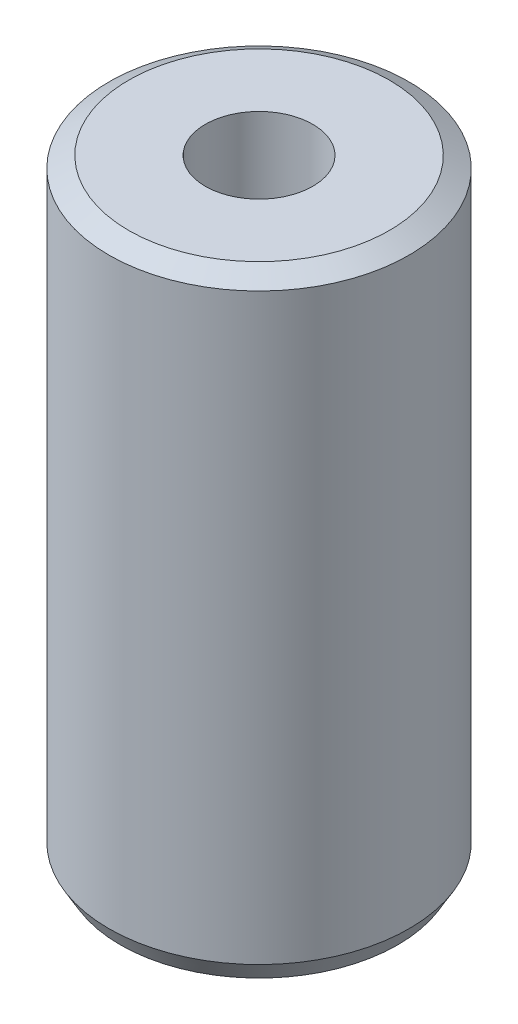
ISO-10303-21;
HEADER;
FILE_DESCRIPTION(('STEP AP214'),'2;1');
FILE_NAME('part.step','',(''),(''),'','','');
FILE_SCHEMA(('AUTOMOTIVE_DESIGN { 1 0 10303 214 1 1 1 1 }'));
ENDSEC;
DATA;
#1=APPLICATION_CONTEXT('core data for automotive mechanical design processes');
#2=APPLICATION_PROTOCOL_DEFINITION('international standard','automotive_design',2000,#1);
#3=PRODUCT_CONTEXT('',#1,'mechanical');
#4=PRODUCT('Part','Part','',(#3));
#5=PRODUCT_RELATED_PRODUCT_CATEGORY('part','',(#4));
#6=PRODUCT_DEFINITION_FORMATION('','',#4);
#7=PRODUCT_DEFINITION_CONTEXT('part definition',#1,'design');
#8=PRODUCT_DEFINITION('design','',#6,#7);
#9=PRODUCT_DEFINITION_SHAPE('','',#8);
#10=(LENGTH_UNIT() NAMED_UNIT(*) SI_UNIT(.MILLI.,.METRE.));
#11=(NAMED_UNIT(*) PLANE_ANGLE_UNIT() SI_UNIT($,.RADIAN.));
#12=(NAMED_UNIT(*) SI_UNIT($,.STERADIAN.) SOLID_ANGLE_UNIT());
#13=UNCERTAINTY_MEASURE_WITH_UNIT(LENGTH_MEASURE(1.E-05),#10,'distance_accuracy_value','');
#14=(GEOMETRIC_REPRESENTATION_CONTEXT(3) GLOBAL_UNCERTAINTY_ASSIGNED_CONTEXT((#13)) GLOBAL_UNIT_ASSIGNED_CONTEXT((#10,
#11,#12)) REPRESENTATION_CONTEXT('',''));
#15=CARTESIAN_POINT('',(0.,0.,0.));
#16=DIRECTION('',(0.,0.,1.));
#17=DIRECTION('',(1.,0.,0.));
#18=AXIS2_PLACEMENT_3D('',#15,#16,#17);
#19=CARTESIAN_POINT('',(0.,235.427013263918,0.));
#20=DIRECTION('',(0.,-1.,0.));
#21=DIRECTION('',(0.,0.,-1.));
#22=AXIS2_PLACEMENT_3D('',#19,#20,#21);
#23=CYLINDRICAL_SURFACE('',#22,57.5);
#24=CARTESIAN_POINT('',(0.,231.049356313962,0.));
#25=DIRECTION('',(0.,1.,0.));
#26=DIRECTION('',(0.,0.,1.));
#27=AXIS2_PLACEMENT_3D('',#24,#25,#26);
#28=CIRCLE('',#27,57.5);
#29=CARTESIAN_POINT('',(0.,231.049356313962,57.5));
#30=VERTEX_POINT('',#29);
#31=EDGE_CURVE('E50',#30,#30,#28,.F.);
#32=ORIENTED_EDGE('',*,*,#31,.T.);
#33=EDGE_LOOP('',(#32));
#34=FACE_BOUND('',#33,.T.);
#35=CARTESIAN_POINT('',(0.,7.58232425542985,0.));
#36=DIRECTION('',(0.,1.,0.));
#37=DIRECTION('',(0.,0.,1.));
#38=AXIS2_PLACEMENT_3D('',#35,#36,#37);
#39=CIRCLE('',#38,57.5);
#40=CARTESIAN_POINT('',(0.,7.58232425542985,57.5));
#41=VERTEX_POINT('',#40);
#42=EDGE_CURVE('E51',#41,#41,#39,.T.);
#43=ORIENTED_EDGE('',*,*,#42,.T.);
#44=EDGE_LOOP('',(#43));
#45=FACE_BOUND('',#44,.T.);
#46=ADVANCED_FACE('F39',(#34,#45),#23,.T.);
#47=CARTESIAN_POINT('',(0.,235.427013263918,0.));
#48=DIRECTION('',(0.,1.,0.));
#49=DIRECTION('',(0.,0.,1.));
#50=AXIS2_PLACEMENT_3D('',#47,#48,#49);
#51=PLANE('',#50);
#52=CARTESIAN_POINT('',(0.,235.427013263918,0.));
#53=DIRECTION('',(0.,1.,0.));
#54=DIRECTION('',(0.,0.,1.));
#55=AXIS2_PLACEMENT_3D('',#52,#53,#54);
#56=CIRCLE('',#55,49.9176757445702);
#57=CARTESIAN_POINT('',(0.,235.427013263918,49.9176757445702));
#58=VERTEX_POINT('',#57);
#59=EDGE_CURVE('E54',#58,#58,#56,.T.);
#60=ORIENTED_EDGE('',*,*,#59,.T.);
#61=EDGE_LOOP('',(#60));
#62=FACE_BOUND('',#61,.T.);
#63=CARTESIAN_POINT('',(0.,235.427013263918,0.));
#64=DIRECTION('',(0.,1.,0.));
#65=DIRECTION('',(0.,0.,1.));
#66=AXIS2_PLACEMENT_3D('',#63,#64,#65);
#67=CIRCLE('',#66,20.5895818621664);
#68=CARTESIAN_POINT('',(0.,235.427013263918,20.5895818621664));
#69=VERTEX_POINT('',#68);
#70=EDGE_CURVE('E58',#69,#69,#67,.T.);
#71=ORIENTED_EDGE('',*,*,#70,.F.);
#72=EDGE_LOOP('',(#71));
#73=FACE_BOUND('',#72,.T.);
#74=ADVANCED_FACE('F69',(#62,#73),#51,.T.);
#75=CARTESIAN_POINT('',(0.,0.,0.));
#76=DIRECTION('',(0.,1.,0.));
#77=DIRECTION('',(0.,0.,1.));
#78=AXIS2_PLACEMENT_3D('',#75,#76,#77);
#79=PLANE('',#78);
#80=CARTESIAN_POINT('',(0.,0.,0.));
#81=DIRECTION('',(0.,1.,0.));
#82=DIRECTION('',(0.,0.,1.));
#83=AXIS2_PLACEMENT_3D('',#80,#81,#82);
#84=CIRCLE('',#83,53.1223430500445);
#85=CARTESIAN_POINT('',(0.,0.,53.1223430500445));
#86=VERTEX_POINT('',#85);
#87=EDGE_CURVE('E10',#86,#86,#84,.F.);
#88=ORIENTED_EDGE('',*,*,#87,.T.);
#89=EDGE_LOOP('',(#88));
#90=FACE_BOUND('',#89,.T.);
#91=CARTESIAN_POINT('',(0.,0.,0.));
#92=DIRECTION('',(0.,1.,0.));
#93=DIRECTION('',(0.,0.,1.));
#94=AXIS2_PLACEMENT_3D('',#91,#92,#93);
#95=CIRCLE('',#94,20.5895818621664);
#96=CARTESIAN_POINT('',(0.,0.,20.5895818621664));
#97=VERTEX_POINT('',#96);
#98=EDGE_CURVE('E63',#97,#97,#95,.T.);
#99=ORIENTED_EDGE('',*,*,#98,.T.);
#100=EDGE_LOOP('',(#99));
#101=FACE_BOUND('',#100,.T.);
#102=ADVANCED_FACE('F75',(#90,#101),#79,.F.);
#103=CARTESIAN_POINT('',(0.,235.427013263918,0.));
#104=DIRECTION('',(0.,-1.,0.));
#105=DIRECTION('',(0.,0.,-1.));
#106=AXIS2_PLACEMENT_3D('',#103,#104,#105);
#107=CYLINDRICAL_SURFACE('',#106,20.5895818621664);
#108=ORIENTED_EDGE('',*,*,#70,.T.);
#109=EDGE_LOOP('',(#108));
#110=FACE_BOUND('',#109,.T.);
#111=ORIENTED_EDGE('',*,*,#98,.F.);
#112=EDGE_LOOP('',(#111));
#113=FACE_BOUND('',#112,.T.);
#114=ADVANCED_FACE('F70',(#110,#113),#107,.F.);
#115=CARTESIAN_POINT('',(0.,235.427013263918,0.));
#116=DIRECTION('',(0.,-1.,0.));
#117=DIRECTION('',(0.,0.,-1.));
#118=AXIS2_PLACEMENT_3D('',#115,#116,#117);
#119=CONICAL_SURFACE('',#118,49.9176757445702,1.04719755119659);
#120=ORIENTED_EDGE('',*,*,#31,.F.);
#121=EDGE_LOOP('',(#120));
#122=FACE_BOUND('',#121,.T.);
#123=ORIENTED_EDGE('',*,*,#59,.F.);
#124=EDGE_LOOP('',(#123));
#125=FACE_BOUND('',#124,.T.);
#126=ADVANCED_FACE('F81',(#122,#125),#119,.T.);
#127=CARTESIAN_POINT('',(0.,7.58232425542985,0.));
#128=DIRECTION('',(0.,1.,0.));
#129=DIRECTION('',(0.,0.,1.));
#130=AXIS2_PLACEMENT_3D('',#127,#128,#129);
#131=CONICAL_SURFACE('',#130,57.5,0.523598775598301);
#132=ORIENTED_EDGE('',*,*,#87,.F.);
#133=EDGE_LOOP('',(#132));
#134=FACE_BOUND('',#133,.T.);
#135=ORIENTED_EDGE('',*,*,#42,.F.);
#136=EDGE_LOOP('',(#135));
#137=FACE_BOUND('',#136,.T.);
#138=ADVANCED_FACE('F45',(#134,#137),#131,.T.);
#139=CLOSED_SHELL('',(#46,#74,#102,#114,#126,#138));
#140=MANIFOLD_SOLID_BREP('B2',#139);
#141=ADVANCED_BREP_SHAPE_REPRESENTATION('',(#18,#140),#14);
#142=SHAPE_DEFINITION_REPRESENTATION(#9,#141);
ENDSEC;
END-ISO-10303-21;
